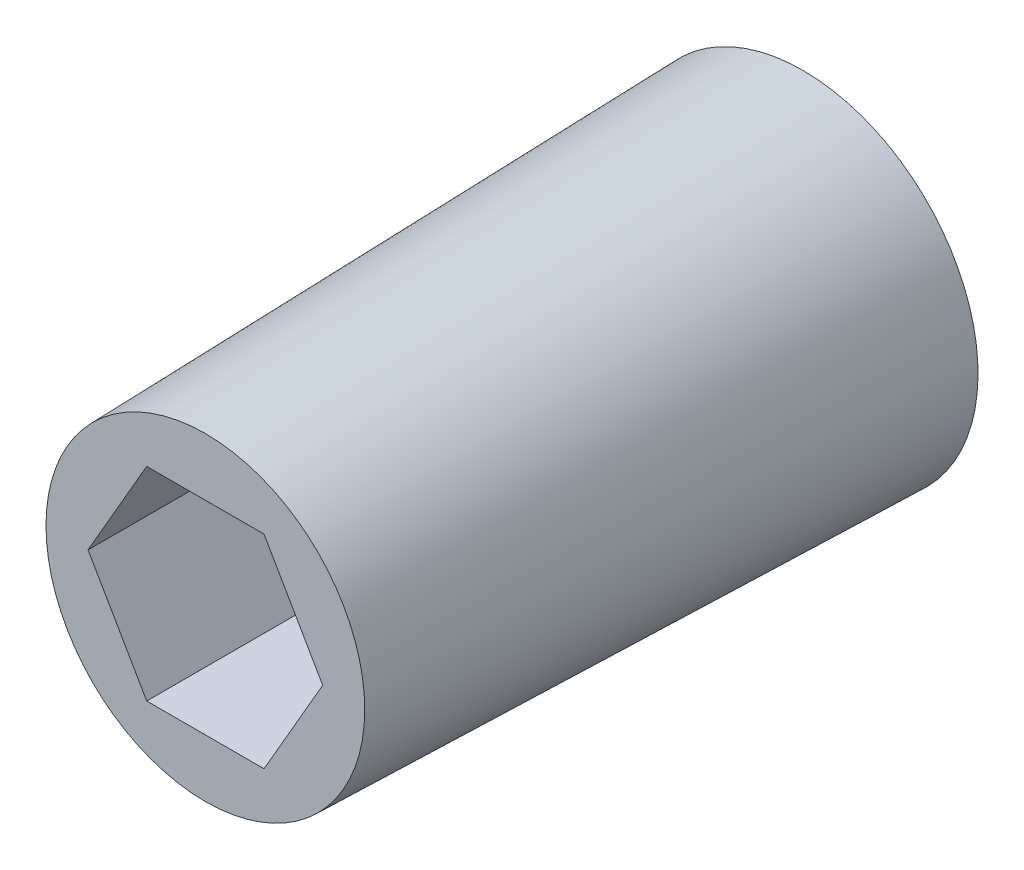
ISO-10303-21;
HEADER;
FILE_DESCRIPTION(('STEP AP214'),'2;1');
FILE_NAME('part.step','',(''),(''),'','','');
FILE_SCHEMA(('AUTOMOTIVE_DESIGN { 1 0 10303 214 1 1 1 1 }'));
ENDSEC;
DATA;
#1=APPLICATION_CONTEXT('core data for automotive mechanical design processes');
#2=APPLICATION_PROTOCOL_DEFINITION('international standard','automotive_design',2000,#1);
#3=PRODUCT_CONTEXT('',#1,'mechanical');
#4=PRODUCT('Part','Part','',(#3));
#5=PRODUCT_RELATED_PRODUCT_CATEGORY('part','',(#4));
#6=PRODUCT_DEFINITION_FORMATION('','',#4);
#7=PRODUCT_DEFINITION_CONTEXT('part definition',#1,'design');
#8=PRODUCT_DEFINITION('design','',#6,#7);
#9=PRODUCT_DEFINITION_SHAPE('','',#8);
#10=(LENGTH_UNIT() NAMED_UNIT(*) SI_UNIT(.MILLI.,.METRE.));
#11=(NAMED_UNIT(*) PLANE_ANGLE_UNIT() SI_UNIT($,.RADIAN.));
#12=(NAMED_UNIT(*) SI_UNIT($,.STERADIAN.) SOLID_ANGLE_UNIT());
#13=UNCERTAINTY_MEASURE_WITH_UNIT(LENGTH_MEASURE(1.E-05),#10,'distance_accuracy_value','');
#14=(GEOMETRIC_REPRESENTATION_CONTEXT(3) GLOBAL_UNCERTAINTY_ASSIGNED_CONTEXT((#13)) GLOBAL_UNIT_ASSIGNED_CONTEXT((#10,
#11,#12)) REPRESENTATION_CONTEXT('',''));
#15=CARTESIAN_POINT('',(0.,0.,0.));
#16=DIRECTION('',(0.,0.,1.));
#17=DIRECTION('',(1.,0.,0.));
#18=AXIS2_PLACEMENT_3D('',#15,#16,#17);
#19=CARTESIAN_POINT('',(-1.47224318643354,-2.55,0.));
#20=DIRECTION('',(0.,-1.,0.));
#21=DIRECTION('',(0.,0.,-1.));
#22=AXIS2_PLACEMENT_3D('',#19,#20,#21);
#23=PLANE('',#22);
#24=DIRECTION('',(0.,0.,1.));
#25=VECTOR('',#24,1.);
#26=CARTESIAN_POINT('',(-1.47224318643355,-2.55,0.));
#27=LINE('',#26,#25);
#28=CARTESIAN_POINT('',(-1.47224318643355,-2.55,-7.5));
#29=VERTEX_POINT('',#28);
#30=CARTESIAN_POINT('',(-1.47224318643355,-2.55,7.5));
#31=VERTEX_POINT('',#30);
#32=EDGE_CURVE('E98',#29,#31,#27,.T.);
#33=ORIENTED_EDGE('',*,*,#32,.T.);
#34=DIRECTION('',(1.,0.,0.));
#35=VECTOR('',#34,1.);
#36=CARTESIAN_POINT('',(0.,-2.55,7.5));
#37=LINE('',#36,#35);
#38=CARTESIAN_POINT('',(1.47224318643355,-2.55,7.5));
#39=VERTEX_POINT('',#38);
#40=EDGE_CURVE('E84',#39,#31,#37,.F.);
#41=ORIENTED_EDGE('',*,*,#40,.F.);
#42=DIRECTION('',(0.,0.,1.));
#43=VECTOR('',#42,1.);
#44=CARTESIAN_POINT('',(1.47224318643355,-2.55,0.));
#45=LINE('',#44,#43);
#46=CARTESIAN_POINT('',(1.47224318643355,-2.55,-7.5));
#47=VERTEX_POINT('',#46);
#48=EDGE_CURVE('E76',#39,#47,#45,.F.);
#49=ORIENTED_EDGE('',*,*,#48,.T.);
#50=DIRECTION('',(1.,0.,0.));
#51=VECTOR('',#50,1.);
#52=CARTESIAN_POINT('',(0.,-2.55,-7.5));
#53=LINE('',#52,#51);
#54=EDGE_CURVE('E103',#47,#29,#53,.F.);
#55=ORIENTED_EDGE('',*,*,#54,.T.);
#56=EDGE_LOOP('',(#33,#41,#49,#55));
#57=FACE_BOUND('',#56,.T.);
#58=ADVANCED_FACE('F17',(#57),#23,.F.);
#59=CARTESIAN_POINT('',(-2.94448637286709,0.,0.));
#60=DIRECTION('',(-0.866025403784439,-0.5,0.));
#61=DIRECTION('',(0.5,-0.866025403784439,0.));
#62=AXIS2_PLACEMENT_3D('',#59,#60,#61);
#63=PLANE('',#62);
#64=DIRECTION('',(0.,0.,1.));
#65=VECTOR('',#64,1.);
#66=CARTESIAN_POINT('',(-2.94448637286709,0.,0.));
#67=LINE('',#66,#65);
#68=CARTESIAN_POINT('',(-2.94448637286709,0.,-7.5));
#69=VERTEX_POINT('',#68);
#70=CARTESIAN_POINT('',(-2.94448637286709,0.,7.5));
#71=VERTEX_POINT('',#70);
#72=EDGE_CURVE('E96',#69,#71,#67,.T.);
#73=ORIENTED_EDGE('',*,*,#72,.T.);
#74=DIRECTION('',(-0.5,0.866025403784439,0.));
#75=VECTOR('',#74,1.);
#76=CARTESIAN_POINT('',(-1.47224318643355,-2.55,7.5));
#77=LINE('',#76,#75);
#78=EDGE_CURVE('E107',#31,#71,#77,.T.);
#79=ORIENTED_EDGE('',*,*,#78,.F.);
#80=ORIENTED_EDGE('',*,*,#32,.F.);
#81=DIRECTION('',(-0.5,0.866025403784439,0.));
#82=VECTOR('',#81,1.);
#83=CARTESIAN_POINT('',(-1.47224318643355,-2.55,-7.5));
#84=LINE('',#83,#82);
#85=EDGE_CURVE('E117',#29,#69,#84,.T.);
#86=ORIENTED_EDGE('',*,*,#85,.T.);
#87=EDGE_LOOP('',(#73,#79,#80,#86));
#88=FACE_BOUND('',#87,.T.);
#89=ADVANCED_FACE('F108',(#88),#63,.F.);
#90=CARTESIAN_POINT('',(-1.47224318643355,2.55,0.));
#91=DIRECTION('',(-0.866025403784439,0.5,0.));
#92=DIRECTION('',(-0.5,-0.866025403784439,0.));
#93=AXIS2_PLACEMENT_3D('',#90,#91,#92);
#94=PLANE('',#93);
#95=DIRECTION('',(0.,0.,1.));
#96=VECTOR('',#95,1.);
#97=CARTESIAN_POINT('',(-1.47224318643355,2.55,0.));
#98=LINE('',#97,#96);
#99=CARTESIAN_POINT('',(-1.47224318643355,2.55,-7.5));
#100=VERTEX_POINT('',#99);
#101=CARTESIAN_POINT('',(-1.47224318643355,2.55,7.5));
#102=VERTEX_POINT('',#101);
#103=EDGE_CURVE('E94',#100,#102,#98,.T.);
#104=ORIENTED_EDGE('',*,*,#103,.T.);
#105=DIRECTION('',(0.5,0.866025403784439,0.));
#106=VECTOR('',#105,1.);
#107=CARTESIAN_POINT('',(-2.94448637286709,0.,7.5));
#108=LINE('',#107,#106);
#109=EDGE_CURVE('E111',#71,#102,#108,.T.);
#110=ORIENTED_EDGE('',*,*,#109,.F.);
#111=ORIENTED_EDGE('',*,*,#72,.F.);
#112=DIRECTION('',(0.5,0.866025403784439,0.));
#113=VECTOR('',#112,1.);
#114=CARTESIAN_POINT('',(-2.94448637286709,0.,-7.5));
#115=LINE('',#114,#113);
#116=EDGE_CURVE('E119',#69,#100,#115,.T.);
#117=ORIENTED_EDGE('',*,*,#116,.T.);
#118=EDGE_LOOP('',(#104,#110,#111,#117));
#119=FACE_BOUND('',#118,.T.);
#120=ADVANCED_FACE('F151',(#119),#94,.F.);
#121=CARTESIAN_POINT('',(1.47224318643355,2.55,0.));
#122=DIRECTION('',(0.,1.,0.));
#123=DIRECTION('',(0.,0.,1.));
#124=AXIS2_PLACEMENT_3D('',#121,#122,#123);
#125=PLANE('',#124);
#126=DIRECTION('',(0.,0.,1.));
#127=VECTOR('',#126,1.);
#128=CARTESIAN_POINT('',(1.47224318643355,2.55,0.));
#129=LINE('',#128,#127);
#130=CARTESIAN_POINT('',(1.47224318643355,2.55,-7.5));
#131=VERTEX_POINT('',#130);
#132=CARTESIAN_POINT('',(1.47224318643355,2.55,7.5));
#133=VERTEX_POINT('',#132);
#134=EDGE_CURVE('E65',#131,#133,#129,.T.);
#135=ORIENTED_EDGE('',*,*,#134,.T.);
#136=DIRECTION('',(1.,0.,0.));
#137=VECTOR('',#136,1.);
#138=CARTESIAN_POINT('',(0.,2.55,7.5));
#139=LINE('',#138,#137);
#140=EDGE_CURVE('E88',#102,#133,#139,.T.);
#141=ORIENTED_EDGE('',*,*,#140,.F.);
#142=ORIENTED_EDGE('',*,*,#103,.F.);
#143=DIRECTION('',(1.,0.,0.));
#144=VECTOR('',#143,1.);
#145=CARTESIAN_POINT('',(0.,2.55,-7.5));
#146=LINE('',#145,#144);
#147=EDGE_CURVE('E121',#100,#131,#146,.T.);
#148=ORIENTED_EDGE('',*,*,#147,.T.);
#149=EDGE_LOOP('',(#135,#141,#142,#148));
#150=FACE_BOUND('',#149,.T.);
#151=ADVANCED_FACE('F153',(#150),#125,.F.);
#152=CARTESIAN_POINT('',(2.94448637286709,0.,0.));
#153=DIRECTION('',(0.866025403784439,0.5,0.));
#154=DIRECTION('',(-0.5,0.866025403784439,0.));
#155=AXIS2_PLACEMENT_3D('',#152,#153,#154);
#156=PLANE('',#155);
#157=DIRECTION('',(0.,0.,1.));
#158=VECTOR('',#157,1.);
#159=CARTESIAN_POINT('',(2.94448637286709,0.,0.));
#160=LINE('',#159,#158);
#161=CARTESIAN_POINT('',(2.94448637286709,0.,-7.5));
#162=VERTEX_POINT('',#161);
#163=CARTESIAN_POINT('',(2.94448637286709,0.,7.5));
#164=VERTEX_POINT('',#163);
#165=EDGE_CURVE('E67',#162,#164,#160,.T.);
#166=ORIENTED_EDGE('',*,*,#165,.T.);
#167=DIRECTION('',(0.5,-0.866025403784439,0.));
#168=VECTOR('',#167,1.);
#169=CARTESIAN_POINT('',(1.47224318643355,2.55,7.5));
#170=LINE('',#169,#168);
#171=EDGE_CURVE('E71',#133,#164,#170,.T.);
#172=ORIENTED_EDGE('',*,*,#171,.F.);
#173=ORIENTED_EDGE('',*,*,#134,.F.);
#174=DIRECTION('',(0.5,-0.866025403784439,0.));
#175=VECTOR('',#174,1.);
#176=CARTESIAN_POINT('',(1.47224318643355,2.55,-7.5));
#177=LINE('',#176,#175);
#178=EDGE_CURVE('E33',#131,#162,#177,.T.);
#179=ORIENTED_EDGE('',*,*,#178,.T.);
#180=EDGE_LOOP('',(#166,#172,#173,#179));
#181=FACE_BOUND('',#180,.T.);
#182=ADVANCED_FACE('F69',(#181),#156,.F.);
#183=CARTESIAN_POINT('',(1.47224318643355,-2.55,0.));
#184=DIRECTION('',(0.866025403784439,-0.5,0.));
#185=DIRECTION('',(0.5,0.866025403784439,0.));
#186=AXIS2_PLACEMENT_3D('',#183,#184,#185);
#187=PLANE('',#186);
#188=ORIENTED_EDGE('',*,*,#48,.F.);
#189=DIRECTION('',(-0.5,-0.866025403784439,0.));
#190=VECTOR('',#189,1.);
#191=CARTESIAN_POINT('',(2.94448637286709,0.,7.5));
#192=LINE('',#191,#190);
#193=EDGE_CURVE('E79',#164,#39,#192,.T.);
#194=ORIENTED_EDGE('',*,*,#193,.F.);
#195=ORIENTED_EDGE('',*,*,#165,.F.);
#196=DIRECTION('',(-0.5,-0.866025403784439,0.));
#197=VECTOR('',#196,1.);
#198=CARTESIAN_POINT('',(2.94448637286709,0.,-7.5));
#199=LINE('',#198,#197);
#200=EDGE_CURVE('E124',#162,#47,#199,.T.);
#201=ORIENTED_EDGE('',*,*,#200,.T.);
#202=EDGE_LOOP('',(#188,#194,#195,#201));
#203=FACE_BOUND('',#202,.T.);
#204=ADVANCED_FACE('F80',(#203),#187,.F.);
#205=CARTESIAN_POINT('',(0.,0.,7.5));
#206=DIRECTION('',(0.,0.,1.));
#207=DIRECTION('',(1.,0.,0.));
#208=AXIS2_PLACEMENT_3D('',#205,#206,#207);
#209=PLANE('',#208);
#210=CARTESIAN_POINT('',(0.,0.,7.49999999999318));
#211=DIRECTION('',(0.,0.,-1.));
#212=DIRECTION('',(0.,1.,0.));
#213=AXIS2_PLACEMENT_3D('',#210,#211,#212);
#214=CIRCLE('',#213,3.99999999999721);
#215=CARTESIAN_POINT('',(0.,3.99999999999721,7.49999999999318));
#216=VERTEX_POINT('',#215);
#217=EDGE_CURVE('E20',#216,#216,#214,.T.);
#218=ORIENTED_EDGE('',*,*,#217,.F.);
#219=EDGE_LOOP('',(#218));
#220=FACE_BOUND('',#219,.T.);
#221=ORIENTED_EDGE('',*,*,#109,.T.);
#222=ORIENTED_EDGE('',*,*,#140,.T.);
#223=ORIENTED_EDGE('',*,*,#171,.T.);
#224=ORIENTED_EDGE('',*,*,#193,.T.);
#225=ORIENTED_EDGE('',*,*,#40,.T.);
#226=ORIENTED_EDGE('',*,*,#78,.T.);
#227=EDGE_LOOP('',(#221,#222,#223,#224,#225,#226));
#228=FACE_BOUND('',#227,.T.);
#229=ADVANCED_FACE('F87',(#220,#228),#209,.T.);
#230=CARTESIAN_POINT('',(0.,0.,-7.5));
#231=DIRECTION('',(0.,0.,1.));
#232=DIRECTION('',(1.,0.,0.));
#233=AXIS2_PLACEMENT_3D('',#230,#231,#232);
#234=PLANE('',#233);
#235=CARTESIAN_POINT('',(0.,0.,-7.49999999999318));
#236=DIRECTION('',(0.,0.,-1.));
#237=DIRECTION('',(0.,1.,0.));
#238=AXIS2_PLACEMENT_3D('',#235,#236,#237);
#239=CIRCLE('',#238,4.39278882308556);
#240=CARTESIAN_POINT('',(0.,4.39278882308556,-7.49999999999318));
#241=VERTEX_POINT('',#240);
#242=EDGE_CURVE('E10',#241,#241,#239,.F.);
#243=ORIENTED_EDGE('',*,*,#242,.F.);
#244=EDGE_LOOP('',(#243));
#245=FACE_BOUND('',#244,.T.);
#246=ORIENTED_EDGE('',*,*,#178,.F.);
#247=ORIENTED_EDGE('',*,*,#147,.F.);
#248=ORIENTED_EDGE('',*,*,#116,.F.);
#249=ORIENTED_EDGE('',*,*,#85,.F.);
#250=ORIENTED_EDGE('',*,*,#54,.F.);
#251=ORIENTED_EDGE('',*,*,#200,.F.);
#252=EDGE_LOOP('',(#246,#247,#248,#249,#250,#251));
#253=FACE_BOUND('',#252,.T.);
#254=ADVANCED_FACE('F131',(#245,#253),#234,.F.);
#255=CARTESIAN_POINT('',(0.,0.,-7.49999999987949));
#256=DIRECTION('',(0.,0.,-1.));
#257=DIRECTION('',(0.,1.,0.));
#258=AXIS2_PLACEMENT_3D('',#255,#256,#257);
#259=CONICAL_SURFACE('',#258,4.39278882308258,0.0261799387499958);
#260=ORIENTED_EDGE('',*,*,#242,.T.);
#261=EDGE_LOOP('',(#260));
#262=FACE_BOUND('',#261,.T.);
#263=ORIENTED_EDGE('',*,*,#217,.T.);
#264=EDGE_LOOP('',(#263));
#265=FACE_BOUND('',#264,.T.);
#266=ADVANCED_FACE('F128',(#262,#265),#259,.T.);
#267=CLOSED_SHELL('',(#58,#89,#120,#151,#182,#204,#229,#254,#266));
#268=MANIFOLD_SOLID_BREP('B1',#267);
#269=ADVANCED_BREP_SHAPE_REPRESENTATION('',(#18,#268),#14);
#270=SHAPE_DEFINITION_REPRESENTATION(#9,#269);
ENDSEC;
END-ISO-10303-21;
